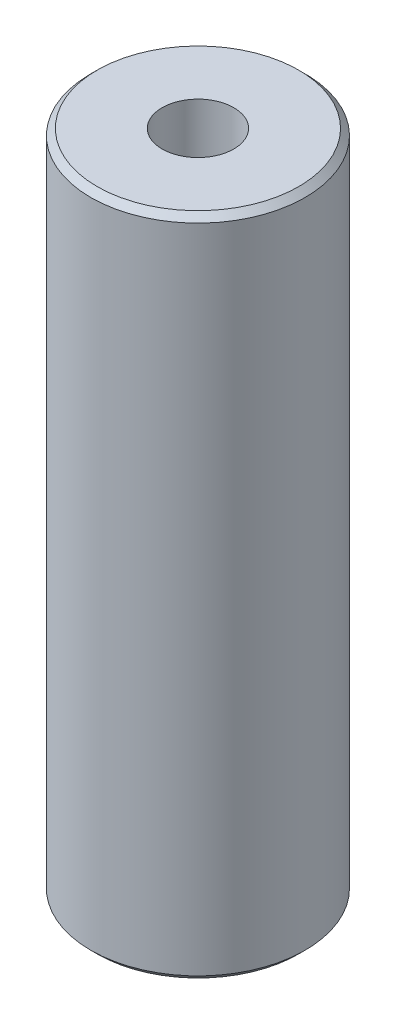
ISO-10303-21;
HEADER;
FILE_DESCRIPTION(('STEP AP214'),'2;1');
FILE_NAME('part.step','',(''),(''),'','','');
FILE_SCHEMA(('AUTOMOTIVE_DESIGN { 1 0 10303 214 1 1 1 1 }'));
ENDSEC;
DATA;
#1=APPLICATION_CONTEXT('core data for automotive mechanical design processes');
#2=APPLICATION_PROTOCOL_DEFINITION('international standard','automotive_design',2000,#1);
#3=PRODUCT_CONTEXT('',#1,'mechanical');
#4=PRODUCT('Part','Part','',(#3));
#5=PRODUCT_RELATED_PRODUCT_CATEGORY('part','',(#4));
#6=PRODUCT_DEFINITION_FORMATION('','',#4);
#7=PRODUCT_DEFINITION_CONTEXT('part definition',#1,'design');
#8=PRODUCT_DEFINITION('design','',#6,#7);
#9=PRODUCT_DEFINITION_SHAPE('','',#8);
#10=(LENGTH_UNIT() NAMED_UNIT(*) SI_UNIT(.MILLI.,.METRE.));
#11=(NAMED_UNIT(*) PLANE_ANGLE_UNIT() SI_UNIT($,.RADIAN.));
#12=(NAMED_UNIT(*) SI_UNIT($,.STERADIAN.) SOLID_ANGLE_UNIT());
#13=UNCERTAINTY_MEASURE_WITH_UNIT(LENGTH_MEASURE(1.E-05),#10,'distance_accuracy_value','');
#14=(GEOMETRIC_REPRESENTATION_CONTEXT(3) GLOBAL_UNCERTAINTY_ASSIGNED_CONTEXT((#13)) GLOBAL_UNIT_ASSIGNED_CONTEXT((#10,
#11,#12)) REPRESENTATION_CONTEXT('',''));
#15=CARTESIAN_POINT('',(0.,0.,0.));
#16=DIRECTION('',(0.,0.,1.));
#17=DIRECTION('',(1.,0.,0.));
#18=AXIS2_PLACEMENT_3D('',#15,#16,#17);
#19=CARTESIAN_POINT('',(0.,325.546605546771,0.));
#20=DIRECTION('',(0.,-1.,0.));
#21=DIRECTION('',(0.,0.,-1.));
#22=AXIS2_PLACEMENT_3D('',#19,#20,#21);
#23=CYLINDRICAL_SURFACE('',#22,52.5);
#24=CARTESIAN_POINT('',(0.,322.45399195164,0.));
#25=DIRECTION('',(0.,1.,0.));
#26=DIRECTION('',(0.,0.,1.));
#27=AXIS2_PLACEMENT_3D('',#24,#25,#26);
#28=CIRCLE('',#27,52.5);
#29=CARTESIAN_POINT('',(0.,322.45399195164,52.5));
#30=VERTEX_POINT('',#29);
#31=EDGE_CURVE('E50',#30,#30,#28,.F.);
#32=ORIENTED_EDGE('',*,*,#31,.T.);
#33=EDGE_LOOP('',(#32));
#34=FACE_BOUND('',#33,.T.);
#35=CARTESIAN_POINT('',(0.,3.0926135951308,0.));
#36=DIRECTION('',(0.,1.,0.));
#37=DIRECTION('',(0.,0.,1.));
#38=AXIS2_PLACEMENT_3D('',#35,#36,#37);
#39=CIRCLE('',#38,52.5);
#40=CARTESIAN_POINT('',(0.,3.0926135951308,52.5));
#41=VERTEX_POINT('',#40);
#42=EDGE_CURVE('E51',#41,#41,#39,.T.);
#43=ORIENTED_EDGE('',*,*,#42,.T.);
#44=EDGE_LOOP('',(#43));
#45=FACE_BOUND('',#44,.T.);
#46=ADVANCED_FACE('F39',(#34,#45),#23,.T.);
#47=CARTESIAN_POINT('',(0.,325.546605546771,0.));
#48=DIRECTION('',(0.,1.,0.));
#49=DIRECTION('',(0.,0.,1.));
#50=AXIS2_PLACEMENT_3D('',#47,#48,#49);
#51=PLANE('',#50);
#52=CARTESIAN_POINT('',(0.,325.546605546771,0.));
#53=DIRECTION('',(0.,1.,0.));
#54=DIRECTION('',(0.,0.,1.));
#55=AXIS2_PLACEMENT_3D('',#52,#53,#54);
#56=CIRCLE('',#55,49.4073864048692);
#57=CARTESIAN_POINT('',(0.,325.546605546771,49.4073864048692));
#58=VERTEX_POINT('',#57);
#59=EDGE_CURVE('E54',#58,#58,#56,.T.);
#60=ORIENTED_EDGE('',*,*,#59,.T.);
#61=EDGE_LOOP('',(#60));
#62=FACE_BOUND('',#61,.T.);
#63=CARTESIAN_POINT('',(0.,325.546605546771,0.));
#64=DIRECTION('',(0.,1.,0.));
#65=DIRECTION('',(0.,0.,1.));
#66=AXIS2_PLACEMENT_3D('',#63,#64,#65);
#67=CIRCLE('',#66,17.5555060812508);
#68=CARTESIAN_POINT('',(0.,325.546605546771,17.5555060812508));
#69=VERTEX_POINT('',#68);
#70=EDGE_CURVE('E58',#69,#69,#67,.T.);
#71=ORIENTED_EDGE('',*,*,#70,.F.);
#72=EDGE_LOOP('',(#71));
#73=FACE_BOUND('',#72,.T.);
#74=ADVANCED_FACE('F69',(#62,#73),#51,.T.);
#75=CARTESIAN_POINT('',(0.,0.,0.));
#76=DIRECTION('',(0.,1.,0.));
#77=DIRECTION('',(0.,0.,1.));
#78=AXIS2_PLACEMENT_3D('',#75,#76,#77);
#79=PLANE('',#78);
#80=CARTESIAN_POINT('',(0.,0.,0.));
#81=DIRECTION('',(0.,1.,0.));
#82=DIRECTION('',(0.,0.,1.));
#83=AXIS2_PLACEMENT_3D('',#80,#81,#82);
#84=CIRCLE('',#83,49.4073864048692);
#85=CARTESIAN_POINT('',(0.,0.,49.4073864048692));
#86=VERTEX_POINT('',#85);
#87=EDGE_CURVE('E10',#86,#86,#84,.F.);
#88=ORIENTED_EDGE('',*,*,#87,.T.);
#89=EDGE_LOOP('',(#88));
#90=FACE_BOUND('',#89,.T.);
#91=CARTESIAN_POINT('',(0.,0.,0.));
#92=DIRECTION('',(0.,1.,0.));
#93=DIRECTION('',(0.,0.,1.));
#94=AXIS2_PLACEMENT_3D('',#91,#92,#93);
#95=CIRCLE('',#94,17.5555060812508);
#96=CARTESIAN_POINT('',(0.,0.,17.5555060812508));
#97=VERTEX_POINT('',#96);
#98=EDGE_CURVE('E63',#97,#97,#95,.T.);
#99=ORIENTED_EDGE('',*,*,#98,.T.);
#100=EDGE_LOOP('',(#99));
#101=FACE_BOUND('',#100,.T.);
#102=ADVANCED_FACE('F75',(#90,#101),#79,.F.);
#103=CARTESIAN_POINT('',(0.,325.546605546771,0.));
#104=DIRECTION('',(0.,-1.,0.));
#105=DIRECTION('',(0.,0.,-1.));
#106=AXIS2_PLACEMENT_3D('',#103,#104,#105);
#107=CYLINDRICAL_SURFACE('',#106,17.5555060812508);
#108=ORIENTED_EDGE('',*,*,#70,.T.);
#109=EDGE_LOOP('',(#108));
#110=FACE_BOUND('',#109,.T.);
#111=ORIENTED_EDGE('',*,*,#98,.F.);
#112=EDGE_LOOP('',(#111));
#113=FACE_BOUND('',#112,.T.);
#114=ADVANCED_FACE('F70',(#110,#113),#107,.F.);
#115=CARTESIAN_POINT('',(0.,325.546605546771,0.));
#116=DIRECTION('',(0.,-1.,0.));
#117=DIRECTION('',(0.,0.,-1.));
#118=AXIS2_PLACEMENT_3D('',#115,#116,#117);
#119=CONICAL_SURFACE('',#118,49.4073864048692,0.785398163397441);
#120=ORIENTED_EDGE('',*,*,#31,.F.);
#121=EDGE_LOOP('',(#120));
#122=FACE_BOUND('',#121,.T.);
#123=ORIENTED_EDGE('',*,*,#59,.F.);
#124=EDGE_LOOP('',(#123));
#125=FACE_BOUND('',#124,.T.);
#126=ADVANCED_FACE('F81',(#122,#125),#119,.T.);
#127=CARTESIAN_POINT('',(0.,3.0926135951308,0.));
#128=DIRECTION('',(0.,1.,0.));
#129=DIRECTION('',(0.,0.,1.));
#130=AXIS2_PLACEMENT_3D('',#127,#128,#129);
#131=CONICAL_SURFACE('',#130,52.5,0.785398163397454);
#132=CARTESIAN_POINT('',(0.,0.,49.4073864048692));
#133=CARTESIAN_POINT('',(0.,0.0322147249492789,49.4396011298184));
#134=CARTESIAN_POINT('',(0.,0.064429449898558,49.4718158547677));
#135=CARTESIAN_POINT('',(0.,0.128858899797116,49.5362453046663));
#136=CARTESIAN_POINT('',(0.,0.161073624746395,49.5684600296156));
#137=CARTESIAN_POINT('',(0.,0.225503074644954,49.6328894795141));
#138=CARTESIAN_POINT('',(0.,0.257717799594234,49.6651042044634));
#139=CARTESIAN_POINT('',(0.,0.322147249492792,49.729533654362));
#140=CARTESIAN_POINT('',(0.,0.35436197444207,49.7617483793112));
#141=CARTESIAN_POINT('',(0.,0.418791424340628,49.8261778292098));
#142=CARTESIAN_POINT('',(0.,0.451006149289908,49.8583925541591));
#143=CARTESIAN_POINT('',(0.,0.515435599188466,49.9228220040576));
#144=CARTESIAN_POINT('',(0.,0.547650324137745,49.9550367290069));
#145=CARTESIAN_POINT('',(0.,0.612079774036304,50.0194661789055));
#146=CARTESIAN_POINT('',(0.,0.644294498985583,50.0516809038548));
#147=CARTESIAN_POINT('',(0.,0.708723948884141,50.1161103537533));
#148=CARTESIAN_POINT('',(0.,0.74093867383342,50.1483250787026));
#149=CARTESIAN_POINT('',(0.,0.805368123731979,50.2127545286011));
#150=CARTESIAN_POINT('',(0.,0.837582848681259,50.2449692535504));
#151=CARTESIAN_POINT('',(0.,0.902012298579817,50.309398703449));
#152=CARTESIAN_POINT('',(0.,0.934227023529095,50.3416134283983));
#153=CARTESIAN_POINT('',(0.,0.998656473427653,50.4060428782968));
#154=CARTESIAN_POINT('',(0.,1.03087119837693,50.4382576032461));
#155=CARTESIAN_POINT('',(0.,1.09530064827549,50.5026870531447));
#156=CARTESIAN_POINT('',(0.,1.12751537322477,50.534901778094));
#157=CARTESIAN_POINT('',(0.,1.19194482312333,50.5993312279925));
#158=CARTESIAN_POINT('',(0.,1.22415954807261,50.6315459529418));
#159=CARTESIAN_POINT('',(0.,1.28858899797117,50.6959754028403));
#160=CARTESIAN_POINT('',(0.,1.32080372292045,50.7281901277896));
#161=CARTESIAN_POINT('',(0.,1.385233172819,50.7926195776882));
#162=CARTESIAN_POINT('',(0.,1.41744789776828,50.8248343026375));
#163=CARTESIAN_POINT('',(0.,1.48187734766684,50.889263752536));
#164=CARTESIAN_POINT('',(0.,1.51409207261612,50.9214784774853));
#165=CARTESIAN_POINT('',(0.,1.57852152251468,50.9859079273839));
#166=CARTESIAN_POINT('',(0.,1.61073624746396,51.0181226523331));
#167=CARTESIAN_POINT('',(0.,1.67516569736252,51.0825521022317));
#168=CARTESIAN_POINT('',(0.,1.70738042231179,51.114766827181));
#169=CARTESIAN_POINT('',(0.,1.77180987221035,51.1791962770795));
#170=CARTESIAN_POINT('',(0.,1.80402459715963,51.2114110020288));
#171=CARTESIAN_POINT('',(0.,1.86845404705819,51.2758404519274));
#172=CARTESIAN_POINT('',(0.,1.90066877200747,51.3080551768767));
#173=CARTESIAN_POINT('',(0.,1.96509822190603,51.3724846267752));
#174=CARTESIAN_POINT('',(0.,1.99731294685531,51.4046993517245));
#175=CARTESIAN_POINT('',(0.,2.06174239675387,51.4691288016231));
#176=CARTESIAN_POINT('',(0.,2.09395712170315,51.5013435265723));
#177=CARTESIAN_POINT('',(0.,2.1583865716017,51.5657729764709));
#178=CARTESIAN_POINT('',(0.,2.19060129655098,51.5979877014202));
#179=CARTESIAN_POINT('',(0.,2.25503074644954,51.6624171513187));
#180=CARTESIAN_POINT('',(0.,2.28724547139882,51.694631876268));
#181=CARTESIAN_POINT('',(0.,2.35167492129738,51.7590613261666));
#182=CARTESIAN_POINT('',(0.,2.38388964624666,51.7912760511159));
#183=CARTESIAN_POINT('',(0.,2.44831909614522,51.8557055010144));
#184=CARTESIAN_POINT('',(0.,2.4805338210945,51.8879202259637));
#185=CARTESIAN_POINT('',(0.,2.54496327099305,51.9523496758622));
#186=CARTESIAN_POINT('',(0.,2.57717799594233,51.9845644008115));
#187=CARTESIAN_POINT('',(0.,2.64160744584089,52.0489938507101));
#188=CARTESIAN_POINT('',(0.,2.67382217079017,52.0812085756594));
#189=CARTESIAN_POINT('',(0.,2.73825162068873,52.1456380255579));
#190=CARTESIAN_POINT('',(0.,2.77046634563801,52.1778527505072));
#191=CARTESIAN_POINT('',(0.,2.83489579553657,52.2422822004058));
#192=CARTESIAN_POINT('',(0.,2.86711052048584,52.274496925355));
#193=CARTESIAN_POINT('',(0.,2.9315399703844,52.3389263752536));
#194=CARTESIAN_POINT('',(0.,2.96375469533368,52.3711411002029));
#195=CARTESIAN_POINT('',(0.,3.02818414523224,52.4355705501014));
#196=CARTESIAN_POINT('',(0.,3.06039887018152,52.4677852750507));
#197=CARTESIAN_POINT('',(0.,3.0926135951308,52.5));
#198=B_SPLINE_CURVE_WITH_KNOTS('',3,(#132,#133,#134,#135,#136,#137,#138,#139,#140,#141,#142,
#143,#144,#145,#146,#147,#148,#149,#150,#151,#152,#153,#154,#155,#156,#157,#158,#159,#160,#161,
#162,#163,#164,#165,#166,#167,#168,#169,#170,#171,#172,#173,#174,#175,#176,#177,#178,#179,#180,
#181,#182,#183,#184,#185,#186,#187,#188,#189,#190,#191,#192,#193,#194,#195,#196,#197),
.UNSPECIFIED.,.F.,.F.,(4,2,2,2,2,2,2,2,2,2,2,2,2,2,2,2,2,2,2,2,2,2,2,2,2,2,2,2,2,2,2,2,4),(0.,
0.136675502794169,0.273351005588337,0.410026508382506,0.546702011176679,0.683377513970848,
0.820053016765016,0.956728519559185,1.09340402235335,1.23007952514752,1.3667550279417,
1.50343053073586,1.64010603353003,1.7767815363242,1.91345703911837,2.05013254191254,
2.18680804470671,2.32348354750088,2.46015905029505,2.59683455308922,2.73351005588338,
2.87018555867755,3.00686106147172,3.1435365642659,3.28021206706006,3.41688756985423,
3.5535630726484,3.69023857544257,3.82691407823674,3.96358958103091,4.10026508382508,
4.23694058661925,4.37361608941342),.UNSPECIFIED.);
#199=EDGE_CURVE('BSEAM45',#86,#41,#198,.T.);
#200=ORIENTED_EDGE('',*,*,#87,.F.);
#201=ORIENTED_EDGE('',*,*,#42,.F.);
#202=ORIENTED_EDGE('',*,*,#199,.T.);
#203=ORIENTED_EDGE('',*,*,#199,.F.);
#204=EDGE_LOOP('',(#200,#202,#201,#203));
#205=FACE_BOUND('',#204,.T.);
#206=ADVANCED_FACE('F45',(#205),#131,.T.);
#207=CLOSED_SHELL('',(#46,#74,#102,#114,#126,#206));
#208=MANIFOLD_SOLID_BREP('B2',#207);
#209=ADVANCED_BREP_SHAPE_REPRESENTATION('',(#18,#208),#14);
#210=SHAPE_DEFINITION_REPRESENTATION(#9,#209);
ENDSEC;
END-ISO-10303-21;
